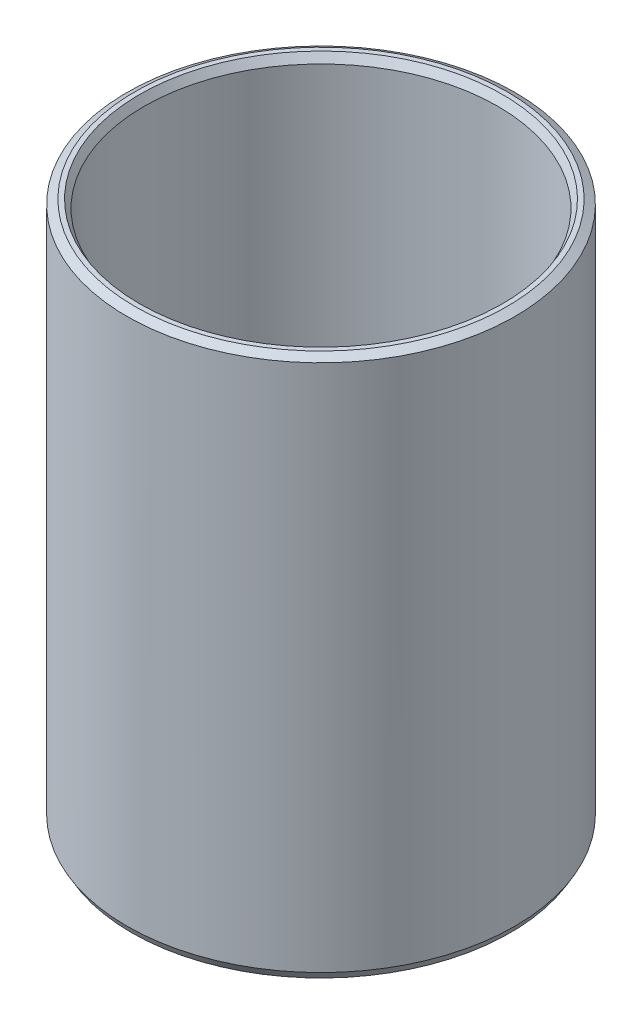
ISO-10303-21;
HEADER;
FILE_DESCRIPTION(('STEP AP214'),'2;1');
FILE_NAME('part.step','',(''),(''),'','','');
FILE_SCHEMA(('AUTOMOTIVE_DESIGN { 1 0 10303 214 1 1 1 1 }'));
ENDSEC;
DATA;
#1=APPLICATION_CONTEXT('core data for automotive mechanical design processes');
#2=APPLICATION_PROTOCOL_DEFINITION('international standard','automotive_design',2000,#1);
#3=PRODUCT_CONTEXT('',#1,'mechanical');
#4=PRODUCT('Part','Part','',(#3));
#5=PRODUCT_RELATED_PRODUCT_CATEGORY('part','',(#4));
#6=PRODUCT_DEFINITION_FORMATION('','',#4);
#7=PRODUCT_DEFINITION_CONTEXT('part definition',#1,'design');
#8=PRODUCT_DEFINITION('design','',#6,#7);
#9=PRODUCT_DEFINITION_SHAPE('','',#8);
#10=(LENGTH_UNIT() NAMED_UNIT(*) SI_UNIT(.MILLI.,.METRE.));
#11=(NAMED_UNIT(*) PLANE_ANGLE_UNIT() SI_UNIT($,.RADIAN.));
#12=(NAMED_UNIT(*) SI_UNIT($,.STERADIAN.) SOLID_ANGLE_UNIT());
#13=UNCERTAINTY_MEASURE_WITH_UNIT(LENGTH_MEASURE(1.E-05),#10,'distance_accuracy_value','');
#14=(GEOMETRIC_REPRESENTATION_CONTEXT(3) GLOBAL_UNCERTAINTY_ASSIGNED_CONTEXT((#13)) GLOBAL_UNIT_ASSIGNED_CONTEXT((#10,
#11,#12)) REPRESENTATION_CONTEXT('',''));
#15=CARTESIAN_POINT('',(0.,0.,0.));
#16=DIRECTION('',(0.,0.,1.));
#17=DIRECTION('',(1.,0.,0.));
#18=AXIS2_PLACEMENT_3D('',#15,#16,#17);
#19=CARTESIAN_POINT('',(0.,139.31557743293,0.));
#20=DIRECTION('',(0.,-1.,0.));
#21=DIRECTION('',(0.,0.,-1.));
#22=AXIS2_PLACEMENT_3D('',#19,#20,#21);
#23=CYLINDRICAL_SURFACE('',#22,50.);
#24=CARTESIAN_POINT('',(0.,2.0515965450574,0.));
#25=DIRECTION('',(0.,1.,0.));
#26=DIRECTION('',(0.,0.,1.));
#27=AXIS2_PLACEMENT_3D('',#24,#25,#26);
#28=CIRCLE('',#27,50.);
#29=CARTESIAN_POINT('',(0.,2.0515965450574,50.));
#30=VERTEX_POINT('',#29);
#31=EDGE_CURVE('E10',#30,#30,#28,.T.);
#32=ORIENTED_EDGE('',*,*,#31,.T.);
#33=EDGE_LOOP('',(#32));
#34=FACE_BOUND('',#33,.T.);
#35=CARTESIAN_POINT('',(0.,138.131087615372,0.));
#36=DIRECTION('',(0.,1.,0.));
#37=DIRECTION('',(0.,0.,1.));
#38=AXIS2_PLACEMENT_3D('',#35,#36,#37);
#39=CIRCLE('',#38,50.);
#40=CARTESIAN_POINT('',(0.,138.131087615372,-50.));
#41=VERTEX_POINT('',#40);
#42=EDGE_CURVE('E50',#41,#41,#39,.F.);
#43=ORIENTED_EDGE('',*,*,#42,.T.);
#44=EDGE_LOOP('',(#43));
#45=FACE_BOUND('',#44,.T.);
#46=ADVANCED_FACE('F39',(#34,#45),#23,.T.);
#47=CARTESIAN_POINT('',(0.,139.31557743293,0.));
#48=DIRECTION('',(0.,1.,0.));
#49=DIRECTION('',(0.,0.,1.));
#50=AXIS2_PLACEMENT_3D('',#47,#48,#49);
#51=PLANE('',#50);
#52=CARTESIAN_POINT('',(0.,139.31557743293,0.));
#53=DIRECTION('',(0.,1.,0.));
#54=DIRECTION('',(0.,0.,1.));
#55=AXIS2_PLACEMENT_3D('',#52,#53,#54);
#56=CIRCLE('',#55,46.7393851911412);
#57=CARTESIAN_POINT('',(0.,139.31557743293,46.7393851911412));
#58=VERTEX_POINT('',#57);
#59=EDGE_CURVE('E58',#58,#58,#56,.F.);
#60=ORIENTED_EDGE('',*,*,#59,.T.);
#61=EDGE_LOOP('',(#60));
#62=FACE_BOUND('',#61,.T.);
#63=CARTESIAN_POINT('',(0.,139.31557743293,0.));
#64=DIRECTION('',(0.,1.,0.));
#65=DIRECTION('',(0.,0.,1.));
#66=AXIS2_PLACEMENT_3D('',#63,#64,#65);
#67=CIRCLE('',#66,47.9484034549426);
#68=CARTESIAN_POINT('',(0.,139.31557743293,-47.9484034549426));
#69=VERTEX_POINT('',#68);
#70=EDGE_CURVE('E61',#69,#69,#67,.T.);
#71=ORIENTED_EDGE('',*,*,#70,.T.);
#72=EDGE_LOOP('',(#71));
#73=FACE_BOUND('',#72,.T.);
#74=ADVANCED_FACE('F88',(#62,#73),#51,.T.);
#75=CARTESIAN_POINT('',(0.,0.,0.));
#76=DIRECTION('',(0.,1.,0.));
#77=DIRECTION('',(0.,0.,1.));
#78=AXIS2_PLACEMENT_3D('',#75,#76,#77);
#79=PLANE('',#78);
#80=CARTESIAN_POINT('',(0.,0.,0.));
#81=DIRECTION('',(0.,1.,0.));
#82=DIRECTION('',(0.,0.,1.));
#83=AXIS2_PLACEMENT_3D('',#80,#81,#82);
#84=CIRCLE('',#83,47.6064919186412);
#85=CARTESIAN_POINT('',(0.,0.,-47.6064919186412));
#86=VERTEX_POINT('',#85);
#87=EDGE_CURVE('E51',#86,#86,#84,.T.);
#88=ORIENTED_EDGE('',*,*,#87,.T.);
#89=EDGE_LOOP('',(#88));
#90=FACE_BOUND('',#89,.T.);
#91=CARTESIAN_POINT('',(0.,0.,0.));
#92=DIRECTION('',(0.,1.,0.));
#93=DIRECTION('',(0.,0.,1.));
#94=AXIS2_PLACEMENT_3D('',#91,#92,#93);
#95=CIRCLE('',#94,48.8155101824426);
#96=CARTESIAN_POINT('',(0.,0.,48.8155101824426));
#97=VERTEX_POINT('',#96);
#98=EDGE_CURVE('E54',#97,#97,#95,.F.);
#99=ORIENTED_EDGE('',*,*,#98,.T.);
#100=EDGE_LOOP('',(#99));
#101=FACE_BOUND('',#100,.T.);
#102=ADVANCED_FACE('F83',(#90,#101),#79,.F.);
#103=CARTESIAN_POINT('',(0.,139.31557743293,0.));
#104=DIRECTION('',(0.,-1.,0.));
#105=DIRECTION('',(0.,0.,-1.));
#106=AXIS2_PLACEMENT_3D('',#103,#104,#105);
#107=CYLINDRICAL_SURFACE('',#106,45.5548953735838);
#108=CARTESIAN_POINT('',(0.,137.263980887872,0.));
#109=DIRECTION('',(0.,1.,0.));
#110=DIRECTION('',(0.,0.,1.));
#111=AXIS2_PLACEMENT_3D('',#108,#109,#110);
#112=CIRCLE('',#111,45.5548953735838);
#113=CARTESIAN_POINT('',(0.,137.263980887872,45.5548953735838));
#114=VERTEX_POINT('',#113);
#115=EDGE_CURVE('E67',#114,#114,#112,.T.);
#116=ORIENTED_EDGE('',*,*,#115,.T.);
#117=EDGE_LOOP('',(#116));
#118=FACE_BOUND('',#117,.T.);
#119=CARTESIAN_POINT('',(0.,1.18448981755742,0.));
#120=DIRECTION('',(0.,1.,0.));
#121=DIRECTION('',(0.,0.,1.));
#122=AXIS2_PLACEMENT_3D('',#119,#120,#121);
#123=CIRCLE('',#122,45.5548953735838);
#124=CARTESIAN_POINT('',(0.,1.18448981755742,-45.5548953735838));
#125=VERTEX_POINT('',#124);
#126=EDGE_CURVE('E69',#125,#125,#123,.F.);
#127=ORIENTED_EDGE('',*,*,#126,.T.);
#128=EDGE_LOOP('',(#127));
#129=FACE_BOUND('',#128,.T.);
#130=ADVANCED_FACE('F71',(#118,#129),#107,.F.);
#131=CARTESIAN_POINT('',(0.,137.263980887872,0.));
#132=DIRECTION('',(0.,1.,0.));
#133=DIRECTION('',(0.,0.,1.));
#134=AXIS2_PLACEMENT_3D('',#131,#132,#133);
#135=CONICAL_SURFACE('',#134,45.5548953735838,0.523598775598299);
#136=ORIENTED_EDGE('',*,*,#59,.F.);
#137=EDGE_LOOP('',(#136));
#138=FACE_BOUND('',#137,.T.);
#139=ORIENTED_EDGE('',*,*,#115,.F.);
#140=EDGE_LOOP('',(#139));
#141=FACE_BOUND('',#140,.T.);
#142=ADVANCED_FACE('F77',(#138,#141),#135,.F.);
#143=CARTESIAN_POINT('',(0.,0.,0.));
#144=DIRECTION('',(0.,-1.,0.));
#145=DIRECTION('',(0.,0.,-1.));
#146=AXIS2_PLACEMENT_3D('',#143,#144,#145);
#147=CONICAL_SURFACE('',#146,47.6064919186412,1.04719755119659);
#148=CARTESIAN_POINT('',(0.,1.18448981755742,-45.5548953735838));
#149=CARTESIAN_POINT('',(0.,1.17215138195786,-45.5762661709282));
#150=CARTESIAN_POINT('',(0.,1.15981294635831,-45.5976369682725));
#151=CARTESIAN_POINT('',(0.,1.1351360751592,-45.6403785629612));
#152=CARTESIAN_POINT('',(0.,1.12279763955964,-45.6617493603055));
#153=CARTESIAN_POINT('',(0.,1.09812076836053,-45.7044909549942));
#154=CARTESIAN_POINT('',(0.,1.08578233276097,-45.7258617523386));
#155=CARTESIAN_POINT('',(0.,1.06110546156186,-45.7686033470273));
#156=CARTESIAN_POINT('',(0.,1.0487670259623,-45.7899741443716));
#157=CARTESIAN_POINT('',(0.,1.02409015476319,-45.8327157390603));
#158=CARTESIAN_POINT('',(0.,1.01175171916363,-45.8540865364047));
#159=CARTESIAN_POINT('',(0.,0.987074847964518,-45.8968281310934));
#160=CARTESIAN_POINT('',(0.,0.974736412364961,-45.9181989284377));
#161=CARTESIAN_POINT('',(0.,0.950059541165848,-45.9609405231264));
#162=CARTESIAN_POINT('',(0.,0.937721105566292,-45.9823113204708));
#163=CARTESIAN_POINT('',(0.,0.913044234367179,-46.0250529151595));
#164=CARTESIAN_POINT('',(0.,0.900705798767622,-46.0464237125038));
#165=CARTESIAN_POINT('',(0.,0.876028927568509,-46.0891653071925));
#166=CARTESIAN_POINT('',(0.,0.863690491968953,-46.1105361045368));
#167=CARTESIAN_POINT('',(0.,0.83901362076984,-46.1532776992255));
#168=CARTESIAN_POINT('',(0.,0.826675185170284,-46.1746484965699));
#169=CARTESIAN_POINT('',(0.,0.801998313971171,-46.2173900912586));
#170=CARTESIAN_POINT('',(0.,0.789659878371614,-46.2387608886029));
#171=CARTESIAN_POINT('',(0.,0.764983007172501,-46.2815024832916));
#172=CARTESIAN_POINT('',(0.,0.752644571572945,-46.302873280636));
#173=CARTESIAN_POINT('',(0.,0.727967700373832,-46.3456148753247));
#174=CARTESIAN_POINT('',(0.,0.715629264774275,-46.366985672669));
#175=CARTESIAN_POINT('',(0.,0.690952393575162,-46.4097272673577));
#176=CARTESIAN_POINT('',(0.,0.678613957975606,-46.4310980647021));
#177=CARTESIAN_POINT('',(0.,0.653937086776493,-46.4738396593908));
#178=CARTESIAN_POINT('',(0.,0.641598651176936,-46.4952104567351));
#179=CARTESIAN_POINT('',(0.,0.616921779977823,-46.5379520514238));
#180=CARTESIAN_POINT('',(0.,0.604583344378267,-46.5593228487682));
#181=CARTESIAN_POINT('',(0.,0.579906473179155,-46.6020644434569));
#182=CARTESIAN_POINT('',(0.,0.567568037579598,-46.6234352408012));
#183=CARTESIAN_POINT('',(0.,0.542891166380485,-46.6661768354899));
#184=CARTESIAN_POINT('',(0.,0.530552730780928,-46.6875476328342));
#185=CARTESIAN_POINT('',(0.,0.505875859581815,-46.7302892275229));
#186=CARTESIAN_POINT('',(0.,0.493537423982259,-46.7516600248673));
#187=CARTESIAN_POINT('',(0.,0.468860552783146,-46.794401619556));
#188=CARTESIAN_POINT('',(0.,0.456522117183589,-46.8157724169003));
#189=CARTESIAN_POINT('',(0.,0.431845245984477,-46.858514011589));
#190=CARTESIAN_POINT('',(0.,0.41950681038492,-46.8798848089334));
#191=CARTESIAN_POINT('',(0.,0.394829939185807,-46.9226264036221));
#192=CARTESIAN_POINT('',(0.,0.382491503586251,-46.9439972009664));
#193=CARTESIAN_POINT('',(0.,0.357814632387138,-46.9867387956551));
#194=CARTESIAN_POINT('',(0.,0.345476196787581,-47.0081095929995));
#195=CARTESIAN_POINT('',(0.,0.320799325588468,-47.0508511876882));
#196=CARTESIAN_POINT('',(0.,0.308460889988912,-47.0722219850325));
#197=CARTESIAN_POINT('',(0.,0.283784018789799,-47.1149635797212));
#198=CARTESIAN_POINT('',(0.,0.271445583190242,-47.1363343770655));
#199=CARTESIAN_POINT('',(0.,0.246768711991129,-47.1790759717542));
#200=CARTESIAN_POINT('',(0.,0.234430276391573,-47.2004467690986));
#201=CARTESIAN_POINT('',(0.,0.20975340519246,-47.2431883637873));
#202=CARTESIAN_POINT('',(0.,0.197414969592904,-47.2645591611316));
#203=CARTESIAN_POINT('',(0.,0.172738098393791,-47.3073007558203));
#204=CARTESIAN_POINT('',(0.,0.160399662794234,-47.3286715531647));
#205=CARTESIAN_POINT('',(0.,0.135722791595121,-47.3714131478534));
#206=CARTESIAN_POINT('',(0.,0.123384355995565,-47.3927839451977));
#207=CARTESIAN_POINT('',(0.,0.0987074847964518,-47.4355255398864));
#208=CARTESIAN_POINT('',(0.,0.0863690491968953,-47.4568963372308));
#209=CARTESIAN_POINT('',(0.,0.0616921779977823,-47.4996379319195));
#210=CARTESIAN_POINT('',(0.,0.0493537423982259,-47.5210087292638));
#211=CARTESIAN_POINT('',(0.,0.0246768711991129,-47.5637503239525));
#212=CARTESIAN_POINT('',(0.,0.0123384355995565,-47.5851211212968));
#213=CARTESIAN_POINT('',(0.,0.,-47.6064919186412));
#214=B_SPLINE_CURVE_WITH_KNOTS('',3,(#148,#149,#150,#151,#152,#153,#154,#155,#156,#157,#158,
#159,#160,#161,#162,#163,#164,#165,#166,#167,#168,#169,#170,#171,#172,#173,#174,#175,#176,#177,
#178,#179,#180,#181,#182,#183,#184,#185,#186,#187,#188,#189,#190,#191,#192,#193,#194,#195,#196,
#197,#198,#199,#200,#201,#202,#203,#204,#205,#206,#207,#208,#209,#210,#211,#212,#213),
.UNSPECIFIED.,.F.,.F.,(4,2,2,2,2,2,2,2,2,2,2,2,2,2,2,2,2,2,2,2,2,2,2,2,2,2,2,2,2,2,2,2,4),(0.,
0.074030613597337,0.148061227194674,0.222091840792011,0.296122454389348,0.370153067986685,
0.444183681584022,0.518214295181359,0.592244908778696,0.666275522376033,0.74030613597337,
0.814336749570707,0.888367363168044,0.962397976765381,1.03642859036272,1.11045920396006,
1.1844898175574,1.25852043115474,1.33255104475207,1.40658165834941,1.48061227194675,
1.55464288554408,1.62867349914142,1.70270411273876,1.77673472633609,1.85076533993343,
1.92479595353077,1.99882656712811,2.07285718072544,2.14688779432278,2.22091840792012,
2.29494902151745,2.36897963511479),.UNSPECIFIED.);
#215=EDGE_CURVE('BSEAM73',#125,#86,#214,.T.);
#216=ORIENTED_EDGE('',*,*,#126,.F.);
#217=ORIENTED_EDGE('',*,*,#87,.F.);
#218=ORIENTED_EDGE('',*,*,#215,.T.);
#219=ORIENTED_EDGE('',*,*,#215,.F.);
#220=EDGE_LOOP('',(#216,#218,#217,#219));
#221=FACE_BOUND('',#220,.T.);
#222=ADVANCED_FACE('F73',(#221),#147,.F.);
#223=CARTESIAN_POINT('',(0.,2.0515965450574,0.));
#224=DIRECTION('',(0.,1.,0.));
#225=DIRECTION('',(0.,0.,1.));
#226=AXIS2_PLACEMENT_3D('',#223,#224,#225);
#227=CONICAL_SURFACE('',#226,50.,0.523598775598305);
#228=ORIENTED_EDGE('',*,*,#98,.F.);
#229=EDGE_LOOP('',(#228));
#230=FACE_BOUND('',#229,.T.);
#231=ORIENTED_EDGE('',*,*,#31,.F.);
#232=EDGE_LOOP('',(#231));
#233=FACE_BOUND('',#232,.T.);
#234=ADVANCED_FACE('F76',(#230,#233),#227,.T.);
#235=CARTESIAN_POINT('',(0.,139.31557743293,0.));
#236=DIRECTION('',(0.,-1.,0.));
#237=DIRECTION('',(0.,0.,-1.));
#238=AXIS2_PLACEMENT_3D('',#235,#236,#237);
#239=CONICAL_SURFACE('',#238,47.9484034549426,1.04719755119659);
#240=CARTESIAN_POINT('',(0.,138.131087615372,-50.));
#241=CARTESIAN_POINT('',(0.,138.143426050972,-49.9786292026557));
#242=CARTESIAN_POINT('',(0.,138.155764486571,-49.9572584053113));
#243=CARTESIAN_POINT('',(0.,138.18044135777,-49.9145168106226));
#244=CARTESIAN_POINT('',(0.,138.19277979337,-49.8931460132783));
#245=CARTESIAN_POINT('',(0.,138.217456664569,-49.8504044185896));
#246=CARTESIAN_POINT('',(0.,138.229795100169,-49.8290336212452));
#247=CARTESIAN_POINT('',(0.,138.254471971368,-49.7862920265565));
#248=CARTESIAN_POINT('',(0.,138.266810406967,-49.7649212292122));
#249=CARTESIAN_POINT('',(0.,138.291487278166,-49.7221796345235));
#250=CARTESIAN_POINT('',(0.,138.303825713766,-49.7008088371792));
#251=CARTESIAN_POINT('',(0.,138.328502584965,-49.6580672424905));
#252=CARTESIAN_POINT('',(0.,138.340841020565,-49.6366964451461));
#253=CARTESIAN_POINT('',(0.,138.365517891764,-49.5939548504574));
#254=CARTESIAN_POINT('',(0.,138.377856327363,-49.5725840531131));
#255=CARTESIAN_POINT('',(0.,138.402533198562,-49.5298424584244));
#256=CARTESIAN_POINT('',(0.,138.414871634162,-49.50847166108));
#257=CARTESIAN_POINT('',(0.,138.439548505361,-49.4657300663913));
#258=CARTESIAN_POINT('',(0.,138.451886940961,-49.444359269047));
#259=CARTESIAN_POINT('',(0.,138.47656381216,-49.4016176743583));
#260=CARTESIAN_POINT('',(0.,138.488902247759,-49.3802468770139));
#261=CARTESIAN_POINT('',(0.,138.513579118958,-49.3375052823252));
#262=CARTESIAN_POINT('',(0.,138.525917554558,-49.3161344849809));
#263=CARTESIAN_POINT('',(0.,138.550594425757,-49.2733928902922));
#264=CARTESIAN_POINT('',(0.,138.562932861357,-49.2520220929479));
#265=CARTESIAN_POINT('',(0.,138.587609732556,-49.2092804982592));
#266=CARTESIAN_POINT('',(0.,138.599948168155,-49.1879097009148));
#267=CARTESIAN_POINT('',(0.,138.624625039354,-49.1451681062261));
#268=CARTESIAN_POINT('',(0.,138.636963474954,-49.1237973088818));
#269=CARTESIAN_POINT('',(0.,138.661640346153,-49.0810557141931));
#270=CARTESIAN_POINT('',(0.,138.673978781753,-49.0596849168487));
#271=CARTESIAN_POINT('',(0.,138.698655652952,-49.01694332216));
#272=CARTESIAN_POINT('',(0.,138.710994088551,-48.9955725248157));
#273=CARTESIAN_POINT('',(0.,138.73567095975,-48.952830930127));
#274=CARTESIAN_POINT('',(0.,138.74800939535,-48.9314601327826));
#275=CARTESIAN_POINT('',(0.,138.772686266549,-48.8887185380939));
#276=CARTESIAN_POINT('',(0.,138.785024702149,-48.8673477407496));
#277=CARTESIAN_POINT('',(0.,138.809701573348,-48.8246061460609));
#278=CARTESIAN_POINT('',(0.,138.822040008947,-48.8032353487165));
#279=CARTESIAN_POINT('',(0.,138.846716880146,-48.7604937540278));
#280=CARTESIAN_POINT('',(0.,138.859055315746,-48.7391229566835));
#281=CARTESIAN_POINT('',(0.,138.883732186945,-48.6963813619948));
#282=CARTESIAN_POINT('',(0.,138.896070622545,-48.6750105646505));
#283=CARTESIAN_POINT('',(0.,138.920747493744,-48.6322689699618));
#284=CARTESIAN_POINT('',(0.,138.933085929343,-48.6108981726174));
#285=CARTESIAN_POINT('',(0.,138.957762800542,-48.5681565779287));
#286=CARTESIAN_POINT('',(0.,138.970101236142,-48.5467857805844));
#287=CARTESIAN_POINT('',(0.,138.994778107341,-48.5040441858957));
#288=CARTESIAN_POINT('',(0.,139.007116542941,-48.4826733885513));
#289=CARTESIAN_POINT('',(0.,139.03179341414,-48.4399317938626));
#290=CARTESIAN_POINT('',(0.,139.044131849739,-48.4185609965183));
#291=CARTESIAN_POINT('',(0.,139.068808720938,-48.3758194018296));
#292=CARTESIAN_POINT('',(0.,139.081147156538,-48.3544486044852));
#293=CARTESIAN_POINT('',(0.,139.105824027737,-48.3117070097965));
#294=CARTESIAN_POINT('',(0.,139.118162463337,-48.2903362124522));
#295=CARTESIAN_POINT('',(0.,139.142839334536,-48.2475946177635));
#296=CARTESIAN_POINT('',(0.,139.155177770135,-48.2262238204192));
#297=CARTESIAN_POINT('',(0.,139.179854641334,-48.1834822257305));
#298=CARTESIAN_POINT('',(0.,139.192193076934,-48.1621114283861));
#299=CARTESIAN_POINT('',(0.,139.216869948133,-48.1193698336974));
#300=CARTESIAN_POINT('',(0.,139.229208383733,-48.0979990363531));
#301=CARTESIAN_POINT('',(0.,139.253885254932,-48.0552574416644));
#302=CARTESIAN_POINT('',(0.,139.266223690531,-48.03388664432));
#303=CARTESIAN_POINT('',(0.,139.29090056173,-47.9911450496313));
#304=CARTESIAN_POINT('',(0.,139.30323899733,-47.969774252287));
#305=CARTESIAN_POINT('',(0.,139.31557743293,-47.9484034549426));
#306=B_SPLINE_CURVE_WITH_KNOTS('',3,(#240,#241,#242,#243,#244,#245,#246,#247,#248,#249,#250,
#251,#252,#253,#254,#255,#256,#257,#258,#259,#260,#261,#262,#263,#264,#265,#266,#267,#268,#269,
#270,#271,#272,#273,#274,#275,#276,#277,#278,#279,#280,#281,#282,#283,#284,#285,#286,#287,#288,
#289,#290,#291,#292,#293,#294,#295,#296,#297,#298,#299,#300,#301,#302,#303,#304,#305),
.UNSPECIFIED.,.F.,.F.,(4,2,2,2,2,2,2,2,2,2,2,2,2,2,2,2,2,2,2,2,2,2,2,2,2,2,2,2,2,2,2,2,4),(0.,
0.0740306135973439,0.148061227194682,0.22209184079202,0.296122454389358,0.370153067986696,
0.444183681584033,0.518214295181371,0.592244908778709,0.666275522376047,0.740306135973385,
0.814336749570723,0.888367363168061,0.962397976765398,1.03642859036274,1.11045920396007,
1.1844898175574,1.25852043115474,1.33255104475208,1.40658165834942,1.48061227194676,
1.55464288554409,1.62867349914143,1.70270411273877,1.77673472633611,1.85076533993345,
1.92479595353078,1.99882656712812,2.07285718072546,2.1468877943228,2.22091840792014,
2.29494902151747,2.36897963511482),.UNSPECIFIED.);
#307=EDGE_CURVE('BSEAM45',#41,#69,#306,.T.);
#308=ORIENTED_EDGE('',*,*,#42,.F.);
#309=ORIENTED_EDGE('',*,*,#70,.F.);
#310=ORIENTED_EDGE('',*,*,#307,.T.);
#311=ORIENTED_EDGE('',*,*,#307,.F.);
#312=EDGE_LOOP('',(#308,#310,#309,#311));
#313=FACE_BOUND('',#312,.T.);
#314=ADVANCED_FACE('F45',(#313),#239,.T.);
#315=CLOSED_SHELL('',(#46,#74,#102,#130,#142,#222,#234,#314));
#316=MANIFOLD_SOLID_BREP('B2',#315);
#317=ADVANCED_BREP_SHAPE_REPRESENTATION('',(#18,#316),#14);
#318=SHAPE_DEFINITION_REPRESENTATION(#9,#317);
ENDSEC;
END-ISO-10303-21;
